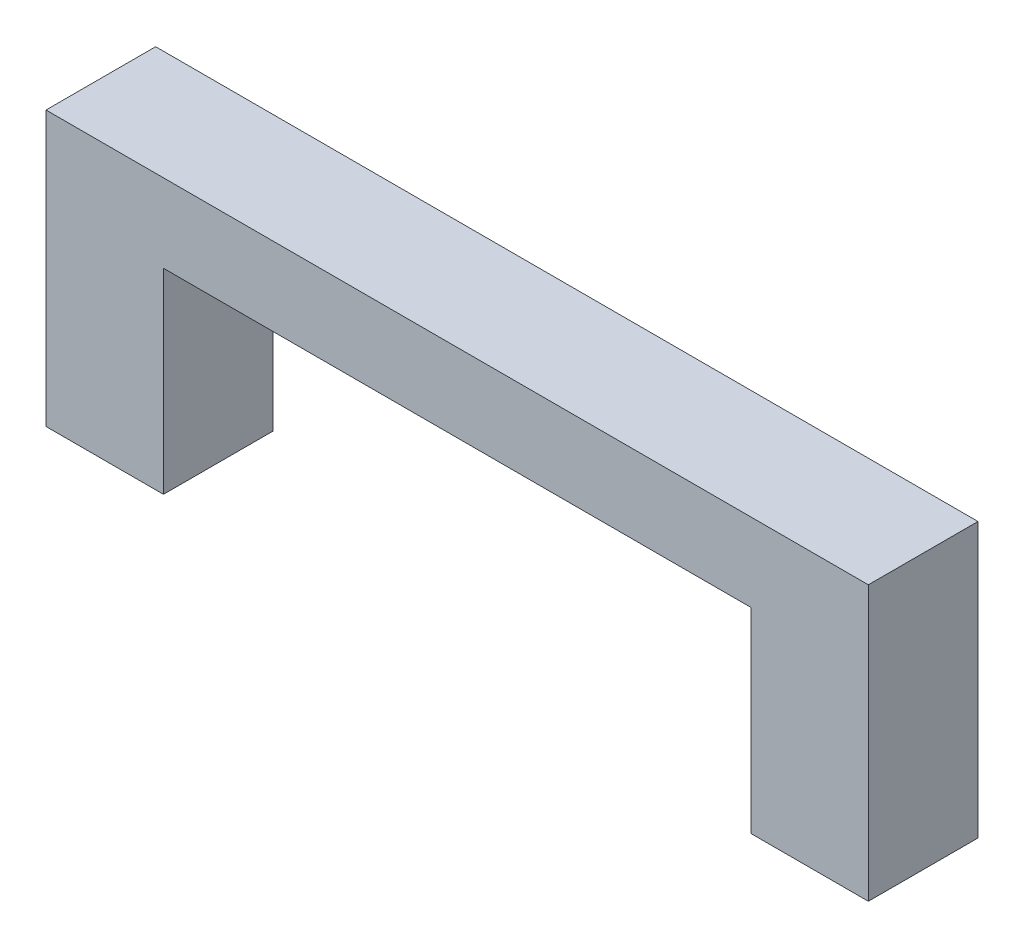
ISO-10303-21;
HEADER;
FILE_DESCRIPTION(('STEP AP214'),'2;1');
FILE_NAME('part.step','',(''),(''),'','','');
FILE_SCHEMA(('AUTOMOTIVE_DESIGN { 1 0 10303 214 1 1 1 1 }'));
ENDSEC;
DATA;
#1=APPLICATION_CONTEXT('core data for automotive mechanical design processes');
#2=APPLICATION_PROTOCOL_DEFINITION('international standard','automotive_design',2000,#1);
#3=PRODUCT_CONTEXT('',#1,'mechanical');
#4=PRODUCT('Part','Part','',(#3));
#5=PRODUCT_RELATED_PRODUCT_CATEGORY('part','',(#4));
#6=PRODUCT_DEFINITION_FORMATION('','',#4);
#7=PRODUCT_DEFINITION_CONTEXT('part definition',#1,'design');
#8=PRODUCT_DEFINITION('design','',#6,#7);
#9=PRODUCT_DEFINITION_SHAPE('','',#8);
#10=(LENGTH_UNIT() NAMED_UNIT(*) SI_UNIT(.MILLI.,.METRE.));
#11=(NAMED_UNIT(*) PLANE_ANGLE_UNIT() SI_UNIT($,.RADIAN.));
#12=(NAMED_UNIT(*) SI_UNIT($,.STERADIAN.) SOLID_ANGLE_UNIT());
#13=UNCERTAINTY_MEASURE_WITH_UNIT(LENGTH_MEASURE(1.E-05),#10,'distance_accuracy_value','');
#14=(GEOMETRIC_REPRESENTATION_CONTEXT(3) GLOBAL_UNCERTAINTY_ASSIGNED_CONTEXT((#13)) GLOBAL_UNIT_ASSIGNED_CONTEXT((#10,
#11,#12)) REPRESENTATION_CONTEXT('',''));
#15=CARTESIAN_POINT('',(0.,0.,0.));
#16=DIRECTION('',(0.,0.,1.));
#17=DIRECTION('',(1.,0.,0.));
#18=AXIS2_PLACEMENT_3D('',#15,#16,#17);
#19=CARTESIAN_POINT('',(21.,0.,2.8));
#20=DIRECTION('',(0.,1.,0.));
#21=DIRECTION('',(-1.,0.,0.));
#22=AXIS2_PLACEMENT_3D('',#19,#20,#21);
#23=PLANE('',#22);
#24=DIRECTION('',(1.,0.,0.));
#25=VECTOR('',#24,1.);
#26=CARTESIAN_POINT('',(21.,0.,0.));
#27=LINE('',#26,#25);
#28=CARTESIAN_POINT('',(18.,0.,0.));
#29=VERTEX_POINT('',#28);
#30=CARTESIAN_POINT('',(21.,0.,0.));
#31=VERTEX_POINT('',#30);
#32=EDGE_CURVE('E236',#29,#31,#27,.T.);
#33=ORIENTED_EDGE('',*,*,#32,.T.);
#34=DIRECTION('',(0.,0.,-1.));
#35=VECTOR('',#34,1.);
#36=CARTESIAN_POINT('',(21.,0.,2.8));
#37=LINE('',#36,#35);
#38=CARTESIAN_POINT('',(21.,0.,2.8));
#39=VERTEX_POINT('',#38);
#40=EDGE_CURVE('E251',#39,#31,#37,.T.);
#41=ORIENTED_EDGE('',*,*,#40,.F.);
#42=DIRECTION('',(1.,0.,0.));
#43=VECTOR('',#42,1.);
#44=CARTESIAN_POINT('',(21.,0.,2.8));
#45=LINE('',#44,#43);
#46=CARTESIAN_POINT('',(18.,0.,2.8));
#47=VERTEX_POINT('',#46);
#48=EDGE_CURVE('E219',#47,#39,#45,.T.);
#49=ORIENTED_EDGE('',*,*,#48,.F.);
#50=DIRECTION('',(0.,0.,-1.));
#51=VECTOR('',#50,1.);
#52=CARTESIAN_POINT('',(18.,0.,2.8));
#53=LINE('',#52,#51);
#54=EDGE_CURVE('E254',#47,#29,#53,.T.);
#55=ORIENTED_EDGE('',*,*,#54,.T.);
#56=EDGE_LOOP('',(#33,#41,#49,#55));
#57=FACE_BOUND('',#56,.T.);
#58=DIRECTION('',(0.,0.,-1.));
#59=VECTOR('',#58,1.);
#60=CARTESIAN_POINT('',(20.5,0.,0.));
#61=LINE('',#60,#59);
#62=CARTESIAN_POINT('',(20.5,0.,2.4));
#63=VERTEX_POINT('',#62);
#64=CARTESIAN_POINT('',(20.5,0.,0.4));
#65=VERTEX_POINT('',#64);
#66=EDGE_CURVE('E56',#63,#65,#61,.T.);
#67=ORIENTED_EDGE('',*,*,#66,.T.);
#68=DIRECTION('',(1.,0.,0.));
#69=VECTOR('',#68,1.);
#70=CARTESIAN_POINT('',(0.,0.,0.4));
#71=LINE('',#70,#69);
#72=CARTESIAN_POINT('',(18.5,0.,0.4));
#73=VERTEX_POINT('',#72);
#74=EDGE_CURVE('E185',#73,#65,#71,.T.);
#75=ORIENTED_EDGE('',*,*,#74,.F.);
#76=DIRECTION('',(0.,0.,-1.));
#77=VECTOR('',#76,1.);
#78=CARTESIAN_POINT('',(18.5,0.,0.));
#79=LINE('',#78,#77);
#80=CARTESIAN_POINT('',(18.5,0.,2.4));
#81=VERTEX_POINT('',#80);
#82=EDGE_CURVE('E196',#81,#73,#79,.T.);
#83=ORIENTED_EDGE('',*,*,#82,.F.);
#84=DIRECTION('',(1.,0.,0.));
#85=VECTOR('',#84,1.);
#86=CARTESIAN_POINT('',(0.,0.,2.4));
#87=LINE('',#86,#85);
#88=EDGE_CURVE('E168',#81,#63,#87,.T.);
#89=ORIENTED_EDGE('',*,*,#88,.T.);
#90=EDGE_LOOP('',(#67,#75,#83,#89));
#91=FACE_BOUND('',#90,.T.);
#92=ADVANCED_FACE('F33',(#57,#91),#23,.F.);
#93=CARTESIAN_POINT('',(3.,0.,2.8));
#94=DIRECTION('',(0.,1.,0.));
#95=DIRECTION('',(-1.,0.,0.));
#96=AXIS2_PLACEMENT_3D('',#93,#94,#95);
#97=PLANE('',#96);
#98=DIRECTION('',(1.,0.,0.));
#99=VECTOR('',#98,1.);
#100=CARTESIAN_POINT('',(0.5,0.,0.4));
#101=LINE('',#100,#99);
#102=CARTESIAN_POINT('',(0.5,0.,0.4));
#103=VERTEX_POINT('',#102);
#104=CARTESIAN_POINT('',(2.5,0.,0.4));
#105=VERTEX_POINT('',#104);
#106=EDGE_CURVE('E166',#103,#105,#101,.T.);
#107=ORIENTED_EDGE('',*,*,#106,.F.);
#108=DIRECTION('',(0.,0.,-1.));
#109=VECTOR('',#108,1.);
#110=CARTESIAN_POINT('',(0.5,0.,2.4));
#111=LINE('',#110,#109);
#112=CARTESIAN_POINT('',(0.5,0.,2.4));
#113=VERTEX_POINT('',#112);
#114=EDGE_CURVE('E48',#113,#103,#111,.T.);
#115=ORIENTED_EDGE('',*,*,#114,.F.);
#116=DIRECTION('',(1.,0.,0.));
#117=VECTOR('',#116,1.);
#118=CARTESIAN_POINT('',(0.5,0.,2.4));
#119=LINE('',#118,#117);
#120=CARTESIAN_POINT('',(2.5,0.,2.4));
#121=VERTEX_POINT('',#120);
#122=EDGE_CURVE('E155',#113,#121,#119,.T.);
#123=ORIENTED_EDGE('',*,*,#122,.T.);
#124=DIRECTION('',(0.,0.,-1.));
#125=VECTOR('',#124,1.);
#126=CARTESIAN_POINT('',(2.5,0.,2.4));
#127=LINE('',#126,#125);
#128=EDGE_CURVE('E161',#121,#105,#127,.T.);
#129=ORIENTED_EDGE('',*,*,#128,.T.);
#130=EDGE_LOOP('',(#107,#115,#123,#129));
#131=FACE_BOUND('',#130,.T.);
#132=DIRECTION('',(1.,0.,0.));
#133=VECTOR('',#132,1.);
#134=CARTESIAN_POINT('',(3.,0.,0.));
#135=LINE('',#134,#133);
#136=CARTESIAN_POINT('',(0.,0.,0.));
#137=VERTEX_POINT('',#136);
#138=CARTESIAN_POINT('',(3.,0.,0.));
#139=VERTEX_POINT('',#138);
#140=EDGE_CURVE('E203',#137,#139,#135,.T.);
#141=ORIENTED_EDGE('',*,*,#140,.T.);
#142=DIRECTION('',(0.,0.,-1.));
#143=VECTOR('',#142,1.);
#144=CARTESIAN_POINT('',(3.,0.,2.8));
#145=LINE('',#144,#143);
#146=CARTESIAN_POINT('',(3.,0.,2.8));
#147=VERTEX_POINT('',#146);
#148=EDGE_CURVE('E11',#147,#139,#145,.T.);
#149=ORIENTED_EDGE('',*,*,#148,.F.);
#150=DIRECTION('',(1.,0.,0.));
#151=VECTOR('',#150,1.);
#152=CARTESIAN_POINT('',(3.,0.,2.8));
#153=LINE('',#152,#151);
#154=CARTESIAN_POINT('',(0.,0.,2.8));
#155=VERTEX_POINT('',#154);
#156=EDGE_CURVE('E209',#155,#147,#153,.T.);
#157=ORIENTED_EDGE('',*,*,#156,.F.);
#158=DIRECTION('',(0.,0.,-1.));
#159=VECTOR('',#158,1.);
#160=CARTESIAN_POINT('',(0.,0.,2.8));
#161=LINE('',#160,#159);
#162=EDGE_CURVE('E227',#155,#137,#161,.T.);
#163=ORIENTED_EDGE('',*,*,#162,.T.);
#164=EDGE_LOOP('',(#141,#149,#157,#163));
#165=FACE_BOUND('',#164,.T.);
#166=ADVANCED_FACE('F35',(#131,#165),#97,.F.);
#167=CARTESIAN_POINT('',(3.,5.,2.8));
#168=DIRECTION('',(-1.,0.,0.));
#169=DIRECTION('',(0.,-1.,0.));
#170=AXIS2_PLACEMENT_3D('',#167,#168,#169);
#171=PLANE('',#170);
#172=DIRECTION('',(0.,1.,0.));
#173=VECTOR('',#172,1.);
#174=CARTESIAN_POINT('',(3.,5.,0.));
#175=LINE('',#174,#173);
#176=CARTESIAN_POINT('',(3.,5.,0.));
#177=VERTEX_POINT('',#176);
#178=EDGE_CURVE('E230',#139,#177,#175,.T.);
#179=ORIENTED_EDGE('',*,*,#178,.T.);
#180=DIRECTION('',(0.,0.,-1.));
#181=VECTOR('',#180,1.);
#182=CARTESIAN_POINT('',(3.,5.,2.8));
#183=LINE('',#182,#181);
#184=CARTESIAN_POINT('',(3.,5.,2.8));
#185=VERTEX_POINT('',#184);
#186=EDGE_CURVE('E41',#185,#177,#183,.T.);
#187=ORIENTED_EDGE('',*,*,#186,.F.);
#188=DIRECTION('',(0.,1.,0.));
#189=VECTOR('',#188,1.);
#190=CARTESIAN_POINT('',(3.,5.,2.8));
#191=LINE('',#190,#189);
#192=EDGE_CURVE('E212',#147,#185,#191,.T.);
#193=ORIENTED_EDGE('',*,*,#192,.F.);
#194=ORIENTED_EDGE('',*,*,#148,.T.);
#195=EDGE_LOOP('',(#179,#187,#193,#194));
#196=FACE_BOUND('',#195,.T.);
#197=ADVANCED_FACE('F287',(#196),#171,.F.);
#198=CARTESIAN_POINT('',(18.,5.,2.8));
#199=DIRECTION('',(0.,1.,0.));
#200=DIRECTION('',(-1.,0.,0.));
#201=AXIS2_PLACEMENT_3D('',#198,#199,#200);
#202=PLANE('',#201);
#203=DIRECTION('',(1.,0.,0.));
#204=VECTOR('',#203,1.);
#205=CARTESIAN_POINT('',(18.,5.,0.));
#206=LINE('',#205,#204);
#207=CARTESIAN_POINT('',(18.,5.,0.));
#208=VERTEX_POINT('',#207);
#209=EDGE_CURVE('E232',#177,#208,#206,.T.);
#210=ORIENTED_EDGE('',*,*,#209,.T.);
#211=DIRECTION('',(0.,0.,-1.));
#212=VECTOR('',#211,1.);
#213=CARTESIAN_POINT('',(18.,5.,2.8));
#214=LINE('',#213,#212);
#215=CARTESIAN_POINT('',(18.,5.,2.8));
#216=VERTEX_POINT('',#215);
#217=EDGE_CURVE('E257',#216,#208,#214,.T.);
#218=ORIENTED_EDGE('',*,*,#217,.F.);
#219=DIRECTION('',(1.,0.,0.));
#220=VECTOR('',#219,1.);
#221=CARTESIAN_POINT('',(18.,5.,2.8));
#222=LINE('',#221,#220);
#223=EDGE_CURVE('E215',#185,#216,#222,.T.);
#224=ORIENTED_EDGE('',*,*,#223,.F.);
#225=ORIENTED_EDGE('',*,*,#186,.T.);
#226=EDGE_LOOP('',(#210,#218,#224,#225));
#227=FACE_BOUND('',#226,.T.);
#228=ADVANCED_FACE('F264',(#227),#202,.F.);
#229=CARTESIAN_POINT('',(18.,0.,2.8));
#230=DIRECTION('',(1.,0.,0.));
#231=DIRECTION('',(0.,0.,-1.));
#232=AXIS2_PLACEMENT_3D('',#229,#230,#231);
#233=PLANE('',#232);
#234=DIRECTION('',(0.,-1.,0.));
#235=VECTOR('',#234,1.);
#236=CARTESIAN_POINT('',(18.,0.,0.));
#237=LINE('',#236,#235);
#238=EDGE_CURVE('E234',#208,#29,#237,.T.);
#239=ORIENTED_EDGE('',*,*,#238,.T.);
#240=ORIENTED_EDGE('',*,*,#54,.F.);
#241=DIRECTION('',(0.,-1.,0.));
#242=VECTOR('',#241,1.);
#243=CARTESIAN_POINT('',(18.,0.,2.8));
#244=LINE('',#243,#242);
#245=EDGE_CURVE('E217',#216,#47,#244,.T.);
#246=ORIENTED_EDGE('',*,*,#245,.F.);
#247=ORIENTED_EDGE('',*,*,#217,.T.);
#248=EDGE_LOOP('',(#239,#240,#246,#247));
#249=FACE_BOUND('',#248,.T.);
#250=ADVANCED_FACE('F275',(#249),#233,.F.);
#251=CARTESIAN_POINT('',(21.,7.,2.8));
#252=DIRECTION('',(-1.,0.,0.));
#253=DIRECTION('',(0.,0.,1.));
#254=AXIS2_PLACEMENT_3D('',#251,#252,#253);
#255=PLANE('',#254);
#256=DIRECTION('',(0.,1.,0.));
#257=VECTOR('',#256,1.);
#258=CARTESIAN_POINT('',(21.,7.,0.));
#259=LINE('',#258,#257);
#260=CARTESIAN_POINT('',(21.,7.,0.));
#261=VERTEX_POINT('',#260);
#262=EDGE_CURVE('E238',#31,#261,#259,.T.);
#263=ORIENTED_EDGE('',*,*,#262,.T.);
#264=DIRECTION('',(0.,0.,-1.));
#265=VECTOR('',#264,1.);
#266=CARTESIAN_POINT('',(21.,7.,2.8));
#267=LINE('',#266,#265);
#268=CARTESIAN_POINT('',(21.,7.,2.8));
#269=VERTEX_POINT('',#268);
#270=EDGE_CURVE('E248',#269,#261,#267,.T.);
#271=ORIENTED_EDGE('',*,*,#270,.F.);
#272=DIRECTION('',(0.,1.,0.));
#273=VECTOR('',#272,1.);
#274=CARTESIAN_POINT('',(21.,7.,2.8));
#275=LINE('',#274,#273);
#276=EDGE_CURVE('E221',#39,#269,#275,.T.);
#277=ORIENTED_EDGE('',*,*,#276,.F.);
#278=ORIENTED_EDGE('',*,*,#40,.T.);
#279=EDGE_LOOP('',(#263,#271,#277,#278));
#280=FACE_BOUND('',#279,.T.);
#281=ADVANCED_FACE('F299',(#280),#255,.F.);
#282=CARTESIAN_POINT('',(0.,7.,2.8));
#283=DIRECTION('',(0.,-1.,0.));
#284=DIRECTION('',(0.,0.,-1.));
#285=AXIS2_PLACEMENT_3D('',#282,#283,#284);
#286=PLANE('',#285);
#287=DIRECTION('',(-1.,0.,0.));
#288=VECTOR('',#287,1.);
#289=CARTESIAN_POINT('',(0.,7.,0.));
#290=LINE('',#289,#288);
#291=CARTESIAN_POINT('',(0.,7.,0.));
#292=VERTEX_POINT('',#291);
#293=EDGE_CURVE('E240',#261,#292,#290,.T.);
#294=ORIENTED_EDGE('',*,*,#293,.T.);
#295=DIRECTION('',(0.,0.,-1.));
#296=VECTOR('',#295,1.);
#297=CARTESIAN_POINT('',(0.,7.,2.8));
#298=LINE('',#297,#296);
#299=CARTESIAN_POINT('',(0.,7.,2.8));
#300=VERTEX_POINT('',#299);
#301=EDGE_CURVE('E245',#300,#292,#298,.T.);
#302=ORIENTED_EDGE('',*,*,#301,.F.);
#303=DIRECTION('',(-1.,0.,0.));
#304=VECTOR('',#303,1.);
#305=CARTESIAN_POINT('',(0.,7.,2.8));
#306=LINE('',#305,#304);
#307=EDGE_CURVE('E223',#269,#300,#306,.T.);
#308=ORIENTED_EDGE('',*,*,#307,.F.);
#309=ORIENTED_EDGE('',*,*,#270,.T.);
#310=EDGE_LOOP('',(#294,#302,#308,#309));
#311=FACE_BOUND('',#310,.T.);
#312=ADVANCED_FACE('F297',(#311),#286,.F.);
#313=CARTESIAN_POINT('',(0.,0.,2.8));
#314=DIRECTION('',(1.,0.,0.));
#315=DIRECTION('',(0.,0.,-1.));
#316=AXIS2_PLACEMENT_3D('',#313,#314,#315);
#317=PLANE('',#316);
#318=DIRECTION('',(0.,-1.,0.));
#319=VECTOR('',#318,1.);
#320=CARTESIAN_POINT('',(0.,0.,0.));
#321=LINE('',#320,#319);
#322=EDGE_CURVE('E213',#292,#137,#321,.T.);
#323=ORIENTED_EDGE('',*,*,#322,.T.);
#324=ORIENTED_EDGE('',*,*,#162,.F.);
#325=DIRECTION('',(0.,-1.,0.));
#326=VECTOR('',#325,1.);
#327=CARTESIAN_POINT('',(0.,0.,2.8));
#328=LINE('',#327,#326);
#329=EDGE_CURVE('E225',#300,#155,#328,.T.);
#330=ORIENTED_EDGE('',*,*,#329,.F.);
#331=ORIENTED_EDGE('',*,*,#301,.T.);
#332=EDGE_LOOP('',(#323,#324,#330,#331));
#333=FACE_BOUND('',#332,.T.);
#334=ADVANCED_FACE('F292',(#333),#317,.F.);
#335=CARTESIAN_POINT('',(0.,0.,2.8));
#336=DIRECTION('',(0.,0.,-1.));
#337=DIRECTION('',(-1.,0.,0.));
#338=AXIS2_PLACEMENT_3D('',#335,#336,#337);
#339=PLANE('',#338);
#340=ORIENTED_EDGE('',*,*,#156,.T.);
#341=ORIENTED_EDGE('',*,*,#192,.T.);
#342=ORIENTED_EDGE('',*,*,#223,.T.);
#343=ORIENTED_EDGE('',*,*,#245,.T.);
#344=ORIENTED_EDGE('',*,*,#48,.T.);
#345=ORIENTED_EDGE('',*,*,#276,.T.);
#346=ORIENTED_EDGE('',*,*,#307,.T.);
#347=ORIENTED_EDGE('',*,*,#329,.T.);
#348=EDGE_LOOP('',(#340,#341,#342,#343,#344,#345,#346,#347));
#349=FACE_BOUND('',#348,.T.);
#350=ADVANCED_FACE('F283',(#349),#339,.F.);
#351=CARTESIAN_POINT('',(0.,0.,0.));
#352=DIRECTION('',(0.,0.,-1.));
#353=DIRECTION('',(-1.,0.,0.));
#354=AXIS2_PLACEMENT_3D('',#351,#352,#353);
#355=PLANE('',#354);
#356=ORIENTED_EDGE('',*,*,#140,.F.);
#357=ORIENTED_EDGE('',*,*,#322,.F.);
#358=ORIENTED_EDGE('',*,*,#293,.F.);
#359=ORIENTED_EDGE('',*,*,#262,.F.);
#360=ORIENTED_EDGE('',*,*,#32,.F.);
#361=ORIENTED_EDGE('',*,*,#238,.F.);
#362=ORIENTED_EDGE('',*,*,#209,.F.);
#363=ORIENTED_EDGE('',*,*,#178,.F.);
#364=EDGE_LOOP('',(#356,#357,#358,#359,#360,#361,#362,#363));
#365=FACE_BOUND('',#364,.T.);
#366=ADVANCED_FACE('F270',(#365),#355,.T.);
#367=CARTESIAN_POINT('',(20.5,2.2,0.));
#368=DIRECTION('',(-1.,0.,0.));
#369=DIRECTION('',(0.,0.,1.));
#370=AXIS2_PLACEMENT_3D('',#367,#368,#369);
#371=PLANE('',#370);
#372=ORIENTED_EDGE('',*,*,#66,.F.);
#373=DIRECTION('',(0.,-1.,0.));
#374=VECTOR('',#373,1.);
#375=CARTESIAN_POINT('',(20.5,2.2,2.4));
#376=LINE('',#375,#374);
#377=CARTESIAN_POINT('',(20.5,2.2,2.4));
#378=VERTEX_POINT('',#377);
#379=EDGE_CURVE('E192',#378,#63,#376,.T.);
#380=ORIENTED_EDGE('',*,*,#379,.F.);
#381=DIRECTION('',(0.,0.,-1.));
#382=VECTOR('',#381,1.);
#383=CARTESIAN_POINT('',(20.5,2.2,0.));
#384=LINE('',#383,#382);
#385=CARTESIAN_POINT('',(20.5,2.2,0.4));
#386=VERTEX_POINT('',#385);
#387=EDGE_CURVE('E182',#378,#386,#384,.T.);
#388=ORIENTED_EDGE('',*,*,#387,.T.);
#389=DIRECTION('',(0.,-1.,0.));
#390=VECTOR('',#389,1.);
#391=CARTESIAN_POINT('',(20.5,2.2,0.4));
#392=LINE('',#391,#390);
#393=EDGE_CURVE('E201',#386,#65,#392,.T.);
#394=ORIENTED_EDGE('',*,*,#393,.T.);
#395=EDGE_LOOP('',(#372,#380,#388,#394));
#396=FACE_BOUND('',#395,.T.);
#397=ADVANCED_FACE('F362',(#396),#371,.T.);
#398=CARTESIAN_POINT('',(0.,2.2,0.4));
#399=DIRECTION('',(0.,0.,-1.));
#400=DIRECTION('',(-1.,0.,0.));
#401=AXIS2_PLACEMENT_3D('',#398,#399,#400);
#402=PLANE('',#401);
#403=ORIENTED_EDGE('',*,*,#74,.T.);
#404=ORIENTED_EDGE('',*,*,#393,.F.);
#405=DIRECTION('',(1.,0.,0.));
#406=VECTOR('',#405,1.);
#407=CARTESIAN_POINT('',(0.,2.2,0.4));
#408=LINE('',#407,#406);
#409=CARTESIAN_POINT('',(18.5,2.2,0.4));
#410=VERTEX_POINT('',#409);
#411=EDGE_CURVE('E190',#410,#386,#408,.T.);
#412=ORIENTED_EDGE('',*,*,#411,.F.);
#413=DIRECTION('',(0.,-1.,0.));
#414=VECTOR('',#413,1.);
#415=CARTESIAN_POINT('',(18.5,2.2,0.4));
#416=LINE('',#415,#414);
#417=EDGE_CURVE('E204',#410,#73,#416,.T.);
#418=ORIENTED_EDGE('',*,*,#417,.T.);
#419=EDGE_LOOP('',(#403,#404,#412,#418));
#420=FACE_BOUND('',#419,.T.);
#421=ADVANCED_FACE('F380',(#420),#402,.F.);
#422=CARTESIAN_POINT('',(18.5,2.2,0.));
#423=DIRECTION('',(-1.,0.,0.));
#424=DIRECTION('',(0.,0.,1.));
#425=AXIS2_PLACEMENT_3D('',#422,#423,#424);
#426=PLANE('',#425);
#427=ORIENTED_EDGE('',*,*,#82,.T.);
#428=ORIENTED_EDGE('',*,*,#417,.F.);
#429=DIRECTION('',(0.,0.,-1.));
#430=VECTOR('',#429,1.);
#431=CARTESIAN_POINT('',(18.5,2.2,0.));
#432=LINE('',#431,#430);
#433=CARTESIAN_POINT('',(18.5,2.2,2.4));
#434=VERTEX_POINT('',#433);
#435=EDGE_CURVE('E187',#434,#410,#432,.T.);
#436=ORIENTED_EDGE('',*,*,#435,.F.);
#437=DIRECTION('',(0.,-1.,0.));
#438=VECTOR('',#437,1.);
#439=CARTESIAN_POINT('',(18.5,2.2,2.4));
#440=LINE('',#439,#438);
#441=EDGE_CURVE('E206',#434,#81,#440,.T.);
#442=ORIENTED_EDGE('',*,*,#441,.T.);
#443=EDGE_LOOP('',(#427,#428,#436,#442));
#444=FACE_BOUND('',#443,.T.);
#445=ADVANCED_FACE('F389',(#444),#426,.F.);
#446=CARTESIAN_POINT('',(0.,2.2,2.4));
#447=DIRECTION('',(0.,0.,-1.));
#448=DIRECTION('',(-1.,0.,0.));
#449=AXIS2_PLACEMENT_3D('',#446,#447,#448);
#450=PLANE('',#449);
#451=ORIENTED_EDGE('',*,*,#88,.F.);
#452=ORIENTED_EDGE('',*,*,#441,.F.);
#453=DIRECTION('',(1.,0.,0.));
#454=VECTOR('',#453,1.);
#455=CARTESIAN_POINT('',(0.,2.2,2.4));
#456=LINE('',#455,#454);
#457=EDGE_CURVE('E184',#434,#378,#456,.T.);
#458=ORIENTED_EDGE('',*,*,#457,.T.);
#459=ORIENTED_EDGE('',*,*,#379,.T.);
#460=EDGE_LOOP('',(#451,#452,#458,#459));
#461=FACE_BOUND('',#460,.T.);
#462=ADVANCED_FACE('F399',(#461),#450,.T.);
#463=CARTESIAN_POINT('',(0.,2.2,0.));
#464=DIRECTION('',(0.,-1.,0.));
#465=DIRECTION('',(0.,0.,-1.));
#466=AXIS2_PLACEMENT_3D('',#463,#464,#465);
#467=PLANE('',#466);
#468=ORIENTED_EDGE('',*,*,#387,.F.);
#469=ORIENTED_EDGE('',*,*,#457,.F.);
#470=ORIENTED_EDGE('',*,*,#435,.T.);
#471=ORIENTED_EDGE('',*,*,#411,.T.);
#472=EDGE_LOOP('',(#468,#469,#470,#471));
#473=FACE_BOUND('',#472,.T.);
#474=ADVANCED_FACE('F409',(#473),#467,.T.);
#475=CARTESIAN_POINT('',(0.5,2.2,2.4));
#476=DIRECTION('',(-1.,0.,0.));
#477=DIRECTION('',(0.,0.,1.));
#478=AXIS2_PLACEMENT_3D('',#475,#476,#477);
#479=PLANE('',#478);
#480=ORIENTED_EDGE('',*,*,#114,.T.);
#481=DIRECTION('',(0.,-1.,0.));
#482=VECTOR('',#481,1.);
#483=CARTESIAN_POINT('',(0.5,2.2,0.4));
#484=LINE('',#483,#482);
#485=CARTESIAN_POINT('',(0.5,2.2,0.4));
#486=VERTEX_POINT('',#485);
#487=EDGE_CURVE('E176',#486,#103,#484,.T.);
#488=ORIENTED_EDGE('',*,*,#487,.F.);
#489=DIRECTION('',(0.,0.,-1.));
#490=VECTOR('',#489,1.);
#491=CARTESIAN_POINT('',(0.5,2.2,2.4));
#492=LINE('',#491,#490);
#493=CARTESIAN_POINT('',(0.5,2.2,2.4));
#494=VERTEX_POINT('',#493);
#495=EDGE_CURVE('E149',#494,#486,#492,.T.);
#496=ORIENTED_EDGE('',*,*,#495,.F.);
#497=DIRECTION('',(0.,-1.,0.));
#498=VECTOR('',#497,1.);
#499=CARTESIAN_POINT('',(0.5,2.2,2.4));
#500=LINE('',#499,#498);
#501=EDGE_CURVE('E145',#494,#113,#500,.T.);
#502=ORIENTED_EDGE('',*,*,#501,.T.);
#503=EDGE_LOOP('',(#480,#488,#496,#502));
#504=FACE_BOUND('',#503,.T.);
#505=ADVANCED_FACE('F147',(#504),#479,.F.);
#506=CARTESIAN_POINT('',(0.5,2.2,2.4));
#507=DIRECTION('',(0.,0.,-1.));
#508=DIRECTION('',(-1.,0.,0.));
#509=AXIS2_PLACEMENT_3D('',#506,#507,#508);
#510=PLANE('',#509);
#511=ORIENTED_EDGE('',*,*,#122,.F.);
#512=ORIENTED_EDGE('',*,*,#501,.F.);
#513=DIRECTION('',(1.,0.,0.));
#514=VECTOR('',#513,1.);
#515=CARTESIAN_POINT('',(0.5,2.2,2.4));
#516=LINE('',#515,#514);
#517=CARTESIAN_POINT('',(2.5,2.2,2.4));
#518=VERTEX_POINT('',#517);
#519=EDGE_CURVE('E173',#494,#518,#516,.T.);
#520=ORIENTED_EDGE('',*,*,#519,.T.);
#521=DIRECTION('',(0.,-1.,0.));
#522=VECTOR('',#521,1.);
#523=CARTESIAN_POINT('',(2.5,2.2,2.4));
#524=LINE('',#523,#522);
#525=EDGE_CURVE('E152',#518,#121,#524,.T.);
#526=ORIENTED_EDGE('',*,*,#525,.T.);
#527=EDGE_LOOP('',(#511,#512,#520,#526));
#528=FACE_BOUND('',#527,.T.);
#529=ADVANCED_FACE('F156',(#528),#510,.T.);
#530=CARTESIAN_POINT('',(2.5,2.2,2.4));
#531=DIRECTION('',(-1.,0.,0.));
#532=DIRECTION('',(0.,0.,1.));
#533=AXIS2_PLACEMENT_3D('',#530,#531,#532);
#534=PLANE('',#533);
#535=ORIENTED_EDGE('',*,*,#128,.F.);
#536=ORIENTED_EDGE('',*,*,#525,.F.);
#537=DIRECTION('',(0.,0.,-1.));
#538=VECTOR('',#537,1.);
#539=CARTESIAN_POINT('',(2.5,2.2,2.4));
#540=LINE('',#539,#538);
#541=CARTESIAN_POINT('',(2.5,2.2,0.4));
#542=VERTEX_POINT('',#541);
#543=EDGE_CURVE('E175',#518,#542,#540,.T.);
#544=ORIENTED_EDGE('',*,*,#543,.T.);
#545=DIRECTION('',(0.,-1.,0.));
#546=VECTOR('',#545,1.);
#547=CARTESIAN_POINT('',(2.5,2.2,0.4));
#548=LINE('',#547,#546);
#549=EDGE_CURVE('E472',#542,#105,#548,.T.);
#550=ORIENTED_EDGE('',*,*,#549,.T.);
#551=EDGE_LOOP('',(#535,#536,#544,#550));
#552=FACE_BOUND('',#551,.T.);
#553=ADVANCED_FACE('F436',(#552),#534,.T.);
#554=CARTESIAN_POINT('',(0.5,2.2,0.4));
#555=DIRECTION('',(0.,0.,-1.));
#556=DIRECTION('',(-1.,0.,0.));
#557=AXIS2_PLACEMENT_3D('',#554,#555,#556);
#558=PLANE('',#557);
#559=ORIENTED_EDGE('',*,*,#106,.T.);
#560=ORIENTED_EDGE('',*,*,#549,.F.);
#561=DIRECTION('',(1.,0.,0.));
#562=VECTOR('',#561,1.);
#563=CARTESIAN_POINT('',(0.5,2.2,0.4));
#564=LINE('',#563,#562);
#565=EDGE_CURVE('E178',#486,#542,#564,.T.);
#566=ORIENTED_EDGE('',*,*,#565,.F.);
#567=ORIENTED_EDGE('',*,*,#487,.T.);
#568=EDGE_LOOP('',(#559,#560,#566,#567));
#569=FACE_BOUND('',#568,.T.);
#570=ADVANCED_FACE('F445',(#569),#558,.F.);
#571=CARTESIAN_POINT('',(0.,2.2,0.));
#572=DIRECTION('',(0.,-1.,0.));
#573=DIRECTION('',(0.,0.,-1.));
#574=AXIS2_PLACEMENT_3D('',#571,#572,#573);
#575=PLANE('',#574);
#576=ORIENTED_EDGE('',*,*,#495,.T.);
#577=ORIENTED_EDGE('',*,*,#565,.T.);
#578=ORIENTED_EDGE('',*,*,#543,.F.);
#579=ORIENTED_EDGE('',*,*,#519,.F.);
#580=EDGE_LOOP('',(#576,#577,#578,#579));
#581=FACE_BOUND('',#580,.T.);
#582=ADVANCED_FACE('F455',(#581),#575,.T.);
#583=CLOSED_SHELL('',(#92,#166,#197,#228,#250,#281,#312,#334,#350,#366,#397,#421,#445,#462,#474,
#505,#529,#553,#570,#582));
#584=MANIFOLD_SOLID_BREP('B2',#583);
#585=ADVANCED_BREP_SHAPE_REPRESENTATION('',(#18,#584),#14);
#586=SHAPE_DEFINITION_REPRESENTATION(#9,#585);
ENDSEC;
END-ISO-10303-21;
